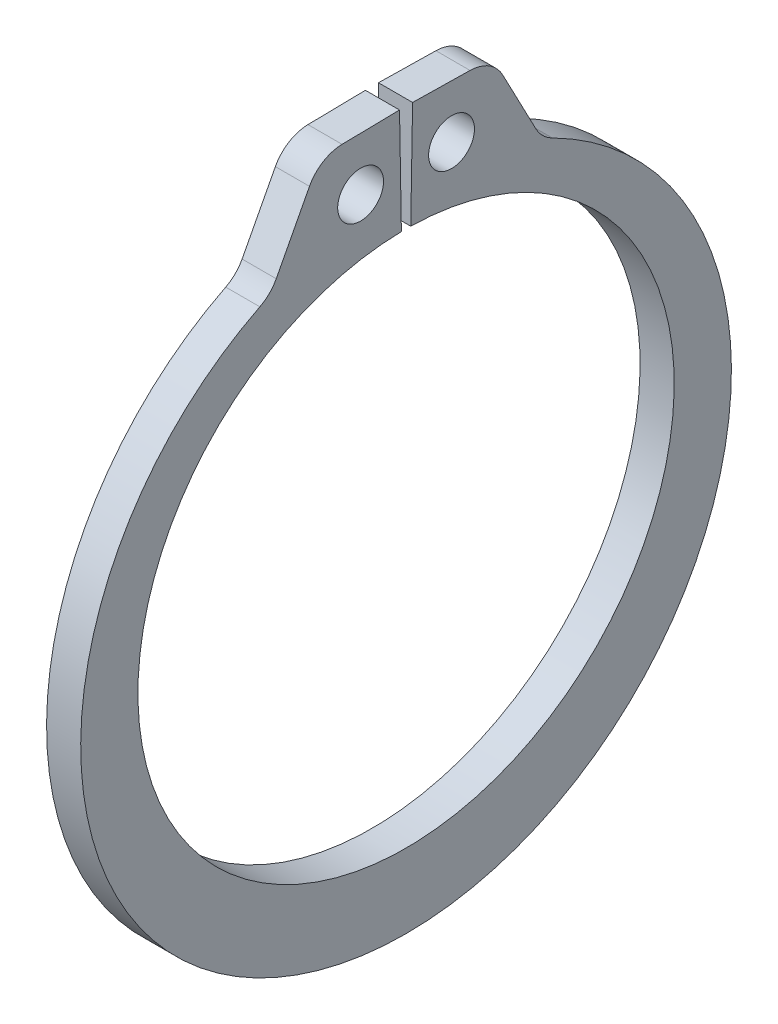
ISO-10303-21;
HEADER;
FILE_DESCRIPTION(('STEP AP214'),'2;1');
FILE_NAME('part.step','',(''),(''),'','','');
FILE_SCHEMA(('AUTOMOTIVE_DESIGN { 1 0 10303 214 1 1 1 1 }'));
ENDSEC;
DATA;
#1=APPLICATION_CONTEXT('core data for automotive mechanical design processes');
#2=APPLICATION_PROTOCOL_DEFINITION('international standard','automotive_design',2000,#1);
#3=PRODUCT_CONTEXT('',#1,'mechanical');
#4=PRODUCT('Part','Part','',(#3));
#5=PRODUCT_RELATED_PRODUCT_CATEGORY('part','',(#4));
#6=PRODUCT_DEFINITION_FORMATION('','',#4);
#7=PRODUCT_DEFINITION_CONTEXT('part definition',#1,'design');
#8=PRODUCT_DEFINITION('design','',#6,#7);
#9=PRODUCT_DEFINITION_SHAPE('','',#8);
#10=(LENGTH_UNIT() NAMED_UNIT(*) SI_UNIT(.MILLI.,.METRE.));
#11=(NAMED_UNIT(*) PLANE_ANGLE_UNIT() SI_UNIT($,.RADIAN.));
#12=(NAMED_UNIT(*) SI_UNIT($,.STERADIAN.) SOLID_ANGLE_UNIT());
#13=UNCERTAINTY_MEASURE_WITH_UNIT(LENGTH_MEASURE(1.E-05),#10,'distance_accuracy_value','');
#14=(GEOMETRIC_REPRESENTATION_CONTEXT(3) GLOBAL_UNCERTAINTY_ASSIGNED_CONTEXT((#13)) GLOBAL_UNIT_ASSIGNED_CONTEXT((#10,
#11,#12)) REPRESENTATION_CONTEXT('',''));
#15=CARTESIAN_POINT('',(0.,0.,0.));
#16=DIRECTION('',(0.,0.,1.));
#17=DIRECTION('',(1.,0.,0.));
#18=AXIS2_PLACEMENT_3D('',#15,#16,#17);
#19=CARTESIAN_POINT('',(0.4445,0.,0.));
#20=DIRECTION('',(1.,0.,0.));
#21=DIRECTION('',(0.,0.,-1.));
#22=AXIS2_PLACEMENT_3D('',#19,#20,#21);
#23=PLANE('',#22);
#24=CARTESIAN_POINT('',(0.4445,8.34990579039907,1.18413129849929));
#25=DIRECTION('',(1.,0.,0.));
#26=DIRECTION('',(0.,0.,-1.));
#27=AXIS2_PLACEMENT_3D('',#24,#25,#26);
#28=CIRCLE('',#27,0.5969);
#29=CARTESIAN_POINT('',(0.4445,8.34990579039907,0.587231298499288));
#30=VERTEX_POINT('',#29);
#31=EDGE_CURVE('E221',#30,#30,#28,.T.);
#32=ORIENTED_EDGE('',*,*,#31,.F.);
#33=EDGE_LOOP('',(#32));
#34=FACE_BOUND('',#33,.T.);
#35=DIRECTION('',(0.,-0.0174524064372785,0.999847695156391));
#36=VECTOR('',#35,1.);
#37=CARTESIAN_POINT('',(0.4445,9.75211447947738,0.170223791426689));
#38=LINE('',#37,#36);
#39=CARTESIAN_POINT('',(0.4445,9.75211447947738,0.170223791426689));
#40=VERTEX_POINT('',#39);
#41=CARTESIAN_POINT('',(0.4445,9.72599428346698,1.66664881865075));
#42=VERTEX_POINT('',#41);
#43=EDGE_CURVE('E133',#40,#42,#38,.T.);
#44=ORIENTED_EDGE('',*,*,#43,.T.);
#45=CARTESIAN_POINT('',(0.4445,8.74824322237355,1.64958211039574));
#46=DIRECTION('',(1.,0.,0.));
#47=DIRECTION('',(0.,0.,-1.));
#48=AXIS2_PLACEMENT_3D('',#45,#46,#47);
#49=CIRCLE('',#48,0.9779);
#50=CARTESIAN_POINT('',(0.4445,9.20239794825594,2.51562592854739));
#51=VERTEX_POINT('',#50);
#52=EDGE_CURVE('E174',#42,#51,#49,.T.);
#53=ORIENTED_EDGE('',*,*,#52,.T.);
#54=DIRECTION('',(0.,-0.885615930209273,0.464418371901418));
#55=VECTOR('',#54,1.);
#56=CARTESIAN_POINT('',(0.4445,9.71587543013069,2.24635753803418));
#57=LINE('',#56,#55);
#58=CARTESIAN_POINT('',(0.4445,7.55065021083085,3.38180501232419));
#59=VERTEX_POINT('',#58);
#60=EDGE_CURVE('E213',#51,#59,#57,.T.);
#61=ORIENTED_EDGE('',*,*,#60,.T.);
#62=CARTESIAN_POINT('',(0.4445,8.00480493671325,4.24784883047584));
#63=DIRECTION('',(1.,0.,0.));
#64=DIRECTION('',(0.,0.,-1.));
#65=AXIS2_PLACEMENT_3D('',#62,#63,#64);
#66=CIRCLE('',#65,0.9779);
#67=CARTESIAN_POINT('',(0.4445,7.13119661908455,3.80842088715641));
#68=VERTEX_POINT('',#67);
#69=EDGE_CURVE('E181',#59,#68,#66,.F.);
#70=ORIENTED_EDGE('',*,*,#69,.T.);
#71=CARTESIAN_POINT('',(0.4445,-0.440165681906266,0.));
#72=DIRECTION('',(1.,0.,0.));
#73=DIRECTION('',(0.,0.,-1.));
#74=AXIS2_PLACEMENT_3D('',#71,#72,#73);
#75=CIRCLE('',#74,8.47523431809375);
#76=CARTESIAN_POINT('',(0.4445,7.13119661908455,-3.80842088715641));
#77=VERTEX_POINT('',#76);
#78=EDGE_CURVE('E206',#68,#77,#75,.T.);
#79=ORIENTED_EDGE('',*,*,#78,.T.);
#80=CARTESIAN_POINT('',(0.4445,8.00480493671325,-4.24784883047584));
#81=DIRECTION('',(1.,0.,0.));
#82=DIRECTION('',(0.,0.,-1.));
#83=AXIS2_PLACEMENT_3D('',#80,#81,#82);
#84=CIRCLE('',#83,0.9779);
#85=CARTESIAN_POINT('',(0.4445,7.55065021083085,-3.38180501232419));
#86=VERTEX_POINT('',#85);
#87=EDGE_CURVE('E11',#77,#86,#84,.F.);
#88=ORIENTED_EDGE('',*,*,#87,.T.);
#89=DIRECTION('',(0.,0.885615930209273,0.464418371901418));
#90=VECTOR('',#89,1.);
#91=CARTESIAN_POINT('',(0.4445,9.71587543013069,-2.24635753803418));
#92=LINE('',#91,#90);
#93=CARTESIAN_POINT('',(0.4445,9.20239794825594,-2.51562592854739));
#94=VERTEX_POINT('',#93);
#95=EDGE_CURVE('E205',#86,#94,#92,.T.);
#96=ORIENTED_EDGE('',*,*,#95,.T.);
#97=CARTESIAN_POINT('',(0.4445,8.74824322237355,-1.64958211039574));
#98=DIRECTION('',(1.,0.,0.));
#99=DIRECTION('',(0.,0.,-1.));
#100=AXIS2_PLACEMENT_3D('',#97,#98,#99);
#101=CIRCLE('',#100,0.9779);
#102=CARTESIAN_POINT('',(0.4445,9.72599428346698,-1.66664881865075));
#103=VERTEX_POINT('',#102);
#104=EDGE_CURVE('E49',#94,#103,#101,.T.);
#105=ORIENTED_EDGE('',*,*,#104,.T.);
#106=DIRECTION('',(0.,0.0174524064372785,0.999847695156391));
#107=VECTOR('',#106,1.);
#108=CARTESIAN_POINT('',(0.4445,9.75211447947738,-0.170223791426689));
#109=LINE('',#108,#107);
#110=CARTESIAN_POINT('',(0.4445,9.75211447947738,-0.170223791426689));
#111=VERTEX_POINT('',#110);
#112=EDGE_CURVE('E210',#103,#111,#109,.T.);
#113=ORIENTED_EDGE('',*,*,#112,.T.);
#114=DIRECTION('',(0.,-0.999847695156391,0.0174524064372834));
#115=VECTOR('',#114,1.);
#116=CARTESIAN_POINT('',(0.4445,6.98393615066739,-0.121905058964426));
#117=LINE('',#116,#115);
#118=CARTESIAN_POINT('',(0.4445,6.98393615066739,-0.121905058964426));
#119=VERTEX_POINT('',#118);
#120=EDGE_CURVE('E139',#111,#119,#117,.T.);
#121=ORIENTED_EDGE('',*,*,#120,.T.);
#122=CARTESIAN_POINT('',(0.4445,0.,0.));
#123=DIRECTION('',(-1.,0.,0.));
#124=DIRECTION('',(0.,0.,-1.));
#125=AXIS2_PLACEMENT_3D('',#122,#123,#124);
#126=CIRCLE('',#125,6.985);
#127=CARTESIAN_POINT('',(0.4445,6.98393615066739,0.121905058964426));
#128=VERTEX_POINT('',#127);
#129=EDGE_CURVE('E134',#119,#128,#126,.T.);
#130=ORIENTED_EDGE('',*,*,#129,.T.);
#131=DIRECTION('',(0.,0.999847695156391,0.0174524064372834));
#132=VECTOR('',#131,1.);
#133=CARTESIAN_POINT('',(0.4445,6.98393615066739,0.121905058964426));
#134=LINE('',#133,#132);
#135=EDGE_CURVE('E125',#128,#40,#134,.T.);
#136=ORIENTED_EDGE('',*,*,#135,.T.);
#137=EDGE_LOOP('',(#44,#53,#61,#70,#79,#88,#96,#105,#113,#121,#130,#136));
#138=FACE_BOUND('',#137,.T.);
#139=CARTESIAN_POINT('',(0.4445,8.34990579039907,-1.18413129849929));
#140=DIRECTION('',(1.,0.,0.));
#141=DIRECTION('',(0.,0.,-1.));
#142=AXIS2_PLACEMENT_3D('',#139,#140,#141);
#143=CIRCLE('',#142,0.5969);
#144=CARTESIAN_POINT('',(0.4445,8.34990579039907,-1.78103129849929));
#145=VERTEX_POINT('',#144);
#146=EDGE_CURVE('E247',#145,#145,#143,.T.);
#147=ORIENTED_EDGE('',*,*,#146,.F.);
#148=EDGE_LOOP('',(#147));
#149=FACE_BOUND('',#148,.T.);
#150=ADVANCED_FACE('F34',(#34,#138,#149),#23,.T.);
#151=CARTESIAN_POINT('',(-0.4445,0.,0.));
#152=DIRECTION('',(1.,0.,0.));
#153=DIRECTION('',(0.,0.,-1.));
#154=AXIS2_PLACEMENT_3D('',#151,#152,#153);
#155=PLANE('',#154);
#156=CARTESIAN_POINT('',(-0.4445,8.34990579039907,1.18413129849929));
#157=DIRECTION('',(1.,0.,0.));
#158=DIRECTION('',(0.,0.,-1.));
#159=AXIS2_PLACEMENT_3D('',#156,#157,#158);
#160=CIRCLE('',#159,0.5969);
#161=CARTESIAN_POINT('',(-0.4445,8.34990579039907,0.587231298499288));
#162=VERTEX_POINT('',#161);
#163=EDGE_CURVE('E244',#162,#162,#160,.T.);
#164=ORIENTED_EDGE('',*,*,#163,.T.);
#165=EDGE_LOOP('',(#164));
#166=FACE_BOUND('',#165,.T.);
#167=DIRECTION('',(0.,-0.885615930209273,0.464418371901418));
#168=VECTOR('',#167,1.);
#169=CARTESIAN_POINT('',(-0.4445,9.71587543013069,2.24635753803418));
#170=LINE('',#169,#168);
#171=CARTESIAN_POINT('',(-0.4445,9.20239794825594,2.51562592854739));
#172=VERTEX_POINT('',#171);
#173=CARTESIAN_POINT('',(-0.4445,7.55065021083085,3.38180501232419));
#174=VERTEX_POINT('',#173);
#175=EDGE_CURVE('E200',#172,#174,#170,.T.);
#176=ORIENTED_EDGE('',*,*,#175,.F.);
#177=CARTESIAN_POINT('',(-0.4445,8.74824322237355,1.64958211039574));
#178=DIRECTION('',(1.,0.,0.));
#179=DIRECTION('',(0.,0.,-1.));
#180=AXIS2_PLACEMENT_3D('',#177,#178,#179);
#181=CIRCLE('',#180,0.9779);
#182=CARTESIAN_POINT('',(-0.4445,9.72599428346698,1.66664881865075));
#183=VERTEX_POINT('',#182);
#184=EDGE_CURVE('E170',#172,#183,#181,.F.);
#185=ORIENTED_EDGE('',*,*,#184,.T.);
#186=DIRECTION('',(0.,-0.0174524064372785,0.999847695156391));
#187=VECTOR('',#186,1.);
#188=CARTESIAN_POINT('',(-0.4445,9.75211447947738,0.170223791426689));
#189=LINE('',#188,#187);
#190=CARTESIAN_POINT('',(-0.4445,9.75211447947738,0.170223791426689));
#191=VERTEX_POINT('',#190);
#192=EDGE_CURVE('E223',#191,#183,#189,.T.);
#193=ORIENTED_EDGE('',*,*,#192,.F.);
#194=DIRECTION('',(0.,0.999847695156391,0.0174524064372834));
#195=VECTOR('',#194,1.);
#196=CARTESIAN_POINT('',(-0.4445,6.98393615066739,0.121905058964426));
#197=LINE('',#196,#195);
#198=CARTESIAN_POINT('',(-0.4445,6.98393615066739,0.121905058964426));
#199=VERTEX_POINT('',#198);
#200=EDGE_CURVE('E220',#199,#191,#197,.T.);
#201=ORIENTED_EDGE('',*,*,#200,.F.);
#202=CARTESIAN_POINT('',(-0.4445,0.,0.));
#203=DIRECTION('',(-1.,0.,0.));
#204=DIRECTION('',(0.,0.,-1.));
#205=AXIS2_PLACEMENT_3D('',#202,#203,#204);
#206=CIRCLE('',#205,6.985);
#207=CARTESIAN_POINT('',(-0.4445,6.98393615066739,-0.121905058964426));
#208=VERTEX_POINT('',#207);
#209=EDGE_CURVE('E147',#208,#199,#206,.T.);
#210=ORIENTED_EDGE('',*,*,#209,.F.);
#211=DIRECTION('',(0.,-0.999847695156391,0.0174524064372834));
#212=VECTOR('',#211,1.);
#213=CARTESIAN_POINT('',(-0.4445,6.98393615066739,-0.121905058964426));
#214=LINE('',#213,#212);
#215=CARTESIAN_POINT('',(-0.4445,9.75211447947738,-0.170223791426689));
#216=VERTEX_POINT('',#215);
#217=EDGE_CURVE('E143',#216,#208,#214,.T.);
#218=ORIENTED_EDGE('',*,*,#217,.F.);
#219=DIRECTION('',(0.,0.0174524064372785,0.999847695156391));
#220=VECTOR('',#219,1.);
#221=CARTESIAN_POINT('',(-0.4445,9.75211447947738,-0.170223791426689));
#222=LINE('',#221,#220);
#223=CARTESIAN_POINT('',(-0.4445,9.72599428346698,-1.66664881865075));
#224=VERTEX_POINT('',#223);
#225=EDGE_CURVE('E228',#224,#216,#222,.T.);
#226=ORIENTED_EDGE('',*,*,#225,.F.);
#227=CARTESIAN_POINT('',(-0.4445,8.74824322237355,-1.64958211039574));
#228=DIRECTION('',(1.,0.,0.));
#229=DIRECTION('',(0.,0.,-1.));
#230=AXIS2_PLACEMENT_3D('',#227,#228,#229);
#231=CIRCLE('',#230,0.9779);
#232=CARTESIAN_POINT('',(-0.4445,9.20239794825594,-2.51562592854739));
#233=VERTEX_POINT('',#232);
#234=EDGE_CURVE('E168',#224,#233,#231,.F.);
#235=ORIENTED_EDGE('',*,*,#234,.T.);
#236=DIRECTION('',(0.,0.885615930209273,0.464418371901418));
#237=VECTOR('',#236,1.);
#238=CARTESIAN_POINT('',(-0.4445,9.71587543013069,-2.24635753803418));
#239=LINE('',#238,#237);
#240=CARTESIAN_POINT('',(-0.4445,7.55065021083085,-3.38180501232419));
#241=VERTEX_POINT('',#240);
#242=EDGE_CURVE('E191',#241,#233,#239,.T.);
#243=ORIENTED_EDGE('',*,*,#242,.F.);
#244=CARTESIAN_POINT('',(-0.4445,8.00480493671325,-4.24784883047584));
#245=DIRECTION('',(1.,0.,0.));
#246=DIRECTION('',(0.,0.,-1.));
#247=AXIS2_PLACEMENT_3D('',#244,#245,#246);
#248=CIRCLE('',#247,0.9779);
#249=CARTESIAN_POINT('',(-0.4445,7.13119661908455,-3.80842088715641));
#250=VERTEX_POINT('',#249);
#251=EDGE_CURVE('E42',#241,#250,#248,.T.);
#252=ORIENTED_EDGE('',*,*,#251,.T.);
#253=CARTESIAN_POINT('',(-0.4445,-0.440165681906266,0.));
#254=DIRECTION('',(1.,0.,0.));
#255=DIRECTION('',(0.,0.,-1.));
#256=AXIS2_PLACEMENT_3D('',#253,#254,#255);
#257=CIRCLE('',#256,8.47523431809375);
#258=CARTESIAN_POINT('',(-0.4445,7.13119661908455,3.80842088715641));
#259=VERTEX_POINT('',#258);
#260=EDGE_CURVE('E189',#259,#250,#257,.T.);
#261=ORIENTED_EDGE('',*,*,#260,.F.);
#262=CARTESIAN_POINT('',(-0.4445,8.00480493671325,4.24784883047584));
#263=DIRECTION('',(1.,0.,0.));
#264=DIRECTION('',(0.,0.,-1.));
#265=AXIS2_PLACEMENT_3D('',#262,#263,#264);
#266=CIRCLE('',#265,0.9779);
#267=EDGE_CURVE('E179',#259,#174,#266,.T.);
#268=ORIENTED_EDGE('',*,*,#267,.T.);
#269=EDGE_LOOP('',(#176,#185,#193,#201,#210,#218,#226,#235,#243,#252,#261,#268));
#270=FACE_BOUND('',#269,.T.);
#271=CARTESIAN_POINT('',(-0.4445,8.34990579039907,-1.18413129849929));
#272=DIRECTION('',(1.,0.,0.));
#273=DIRECTION('',(0.,0.,-1.));
#274=AXIS2_PLACEMENT_3D('',#271,#272,#273);
#275=CIRCLE('',#274,0.5969);
#276=CARTESIAN_POINT('',(-0.4445,8.34990579039907,-1.78103129849929));
#277=VERTEX_POINT('',#276);
#278=EDGE_CURVE('E250',#277,#277,#275,.T.);
#279=ORIENTED_EDGE('',*,*,#278,.T.);
#280=EDGE_LOOP('',(#279));
#281=FACE_BOUND('',#280,.T.);
#282=ADVANCED_FACE('F187',(#166,#270,#281),#155,.F.);
#283=CARTESIAN_POINT('',(0.4445,0.,0.));
#284=DIRECTION('',(-1.,0.,0.));
#285=DIRECTION('',(0.,0.,1.));
#286=AXIS2_PLACEMENT_3D('',#283,#284,#285);
#287=CYLINDRICAL_SURFACE('',#286,6.985);
#288=ORIENTED_EDGE('',*,*,#209,.T.);
#289=DIRECTION('',(-1.,0.,0.));
#290=VECTOR('',#289,1.);
#291=CARTESIAN_POINT('',(0.4445,6.98393615066739,0.121905058964426));
#292=LINE('',#291,#290);
#293=EDGE_CURVE('E129',#128,#199,#292,.T.);
#294=ORIENTED_EDGE('',*,*,#293,.F.);
#295=ORIENTED_EDGE('',*,*,#129,.F.);
#296=DIRECTION('',(-1.,0.,0.));
#297=VECTOR('',#296,1.);
#298=CARTESIAN_POINT('',(0.4445,6.98393615066739,-0.121905058964426));
#299=LINE('',#298,#297);
#300=EDGE_CURVE('E218',#119,#208,#299,.T.);
#301=ORIENTED_EDGE('',*,*,#300,.T.);
#302=EDGE_LOOP('',(#288,#294,#295,#301));
#303=FACE_BOUND('',#302,.T.);
#304=ADVANCED_FACE('F145',(#303),#287,.F.);
#305=CARTESIAN_POINT('',(0.4445,6.98393615066739,0.121905058964426));
#306=DIRECTION('',(0.,-0.0174524064372834,0.999847695156391));
#307=DIRECTION('',(0.,-0.999847695156391,-0.0174524064372834));
#308=AXIS2_PLACEMENT_3D('',#305,#306,#307);
#309=PLANE('',#308);
#310=ORIENTED_EDGE('',*,*,#200,.T.);
#311=DIRECTION('',(-1.,0.,0.));
#312=VECTOR('',#311,1.);
#313=CARTESIAN_POINT('',(0.4445,9.75211447947738,0.170223791426689));
#314=LINE('',#313,#312);
#315=EDGE_CURVE('E132',#40,#191,#314,.T.);
#316=ORIENTED_EDGE('',*,*,#315,.F.);
#317=ORIENTED_EDGE('',*,*,#135,.F.);
#318=ORIENTED_EDGE('',*,*,#293,.T.);
#319=EDGE_LOOP('',(#310,#316,#317,#318));
#320=FACE_BOUND('',#319,.T.);
#321=ADVANCED_FACE('F127',(#320),#309,.F.);
#322=CARTESIAN_POINT('',(0.4445,9.75211447947738,0.170223791426689));
#323=DIRECTION('',(0.,-0.999847695156391,-0.0174524064372785));
#324=DIRECTION('',(0.,0.0174524064372785,-0.999847695156391));
#325=AXIS2_PLACEMENT_3D('',#322,#323,#324);
#326=PLANE('',#325);
#327=ORIENTED_EDGE('',*,*,#192,.T.);
#328=DIRECTION('',(-1.,0.,0.));
#329=VECTOR('',#328,1.);
#330=CARTESIAN_POINT('',(0.4445,9.72599428346698,1.66664881865075));
#331=LINE('',#330,#329);
#332=EDGE_CURVE('E57',#183,#42,#331,.F.);
#333=ORIENTED_EDGE('',*,*,#332,.T.);
#334=ORIENTED_EDGE('',*,*,#43,.F.);
#335=ORIENTED_EDGE('',*,*,#315,.T.);
#336=EDGE_LOOP('',(#327,#333,#334,#335));
#337=FACE_BOUND('',#336,.T.);
#338=ADVANCED_FACE('F239',(#337),#326,.F.);
#339=CARTESIAN_POINT('',(0.4445,9.71587543013069,2.24635753803418));
#340=DIRECTION('',(0.,-0.464418371901418,-0.885615930209273));
#341=DIRECTION('',(0.,0.885615930209273,-0.464418371901418));
#342=AXIS2_PLACEMENT_3D('',#339,#340,#341);
#343=PLANE('',#342);
#344=ORIENTED_EDGE('',*,*,#175,.T.);
#345=DIRECTION('',(1.,0.,0.));
#346=VECTOR('',#345,1.);
#347=CARTESIAN_POINT('',(0.4445,7.55065021083085,3.38180501232419));
#348=LINE('',#347,#346);
#349=EDGE_CURVE('E161',#174,#59,#348,.T.);
#350=ORIENTED_EDGE('',*,*,#349,.T.);
#351=ORIENTED_EDGE('',*,*,#60,.F.);
#352=DIRECTION('',(-1.,0.,0.));
#353=VECTOR('',#352,1.);
#354=CARTESIAN_POINT('',(0.4445,9.20239794825594,2.51562592854739));
#355=LINE('',#354,#353);
#356=EDGE_CURVE('E158',#51,#172,#355,.T.);
#357=ORIENTED_EDGE('',*,*,#356,.T.);
#358=EDGE_LOOP('',(#344,#350,#351,#357));
#359=FACE_BOUND('',#358,.T.);
#360=ADVANCED_FACE('F280',(#359),#343,.F.);
#361=CARTESIAN_POINT('',(0.4445,-0.440165681906266,0.));
#362=DIRECTION('',(-1.,0.,0.));
#363=DIRECTION('',(0.,0.,1.));
#364=AXIS2_PLACEMENT_3D('',#361,#362,#363);
#365=CYLINDRICAL_SURFACE('',#364,8.47523431809375);
#366=ORIENTED_EDGE('',*,*,#78,.F.);
#367=DIRECTION('',(-1.,0.,0.));
#368=VECTOR('',#367,1.);
#369=CARTESIAN_POINT('',(0.4445,7.13119661908455,3.80842088715641));
#370=LINE('',#369,#368);
#371=EDGE_CURVE('E150',#68,#259,#370,.T.);
#372=ORIENTED_EDGE('',*,*,#371,.T.);
#373=ORIENTED_EDGE('',*,*,#260,.T.);
#374=DIRECTION('',(-1.,0.,0.));
#375=VECTOR('',#374,1.);
#376=CARTESIAN_POINT('',(0.4445,7.13119661908455,-3.80842088715641));
#377=LINE('',#376,#375);
#378=EDGE_CURVE('E148',#250,#77,#377,.F.);
#379=ORIENTED_EDGE('',*,*,#378,.T.);
#380=EDGE_LOOP('',(#366,#372,#373,#379));
#381=FACE_BOUND('',#380,.T.);
#382=ADVANCED_FACE('F197',(#381),#365,.T.);
#383=CARTESIAN_POINT('',(0.4445,9.71587543013069,-2.24635753803418));
#384=DIRECTION('',(0.,-0.464418371901418,0.885615930209273));
#385=DIRECTION('',(0.,-0.885615930209273,-0.464418371901418));
#386=AXIS2_PLACEMENT_3D('',#383,#384,#385);
#387=PLANE('',#386);
#388=ORIENTED_EDGE('',*,*,#95,.F.);
#389=DIRECTION('',(1.,0.,0.));
#390=VECTOR('',#389,1.);
#391=CARTESIAN_POINT('',(-0.4445,7.55065021083085,-3.38180501232419));
#392=LINE('',#391,#390);
#393=EDGE_CURVE('E165',#86,#241,#392,.F.);
#394=ORIENTED_EDGE('',*,*,#393,.T.);
#395=ORIENTED_EDGE('',*,*,#242,.T.);
#396=DIRECTION('',(-1.,0.,0.));
#397=VECTOR('',#396,1.);
#398=CARTESIAN_POINT('',(0.4445,9.20239794825594,-2.51562592854739));
#399=LINE('',#398,#397);
#400=EDGE_CURVE('E163',#233,#94,#399,.F.);
#401=ORIENTED_EDGE('',*,*,#400,.T.);
#402=EDGE_LOOP('',(#388,#394,#395,#401));
#403=FACE_BOUND('',#402,.T.);
#404=ADVANCED_FACE('F208',(#403),#387,.F.);
#405=CARTESIAN_POINT('',(0.4445,9.75211447947738,-0.170223791426689));
#406=DIRECTION('',(0.,-0.999847695156391,0.0174524064372785));
#407=DIRECTION('',(0.,-0.0174524064372785,-0.999847695156391));
#408=AXIS2_PLACEMENT_3D('',#405,#406,#407);
#409=PLANE('',#408);
#410=ORIENTED_EDGE('',*,*,#112,.F.);
#411=DIRECTION('',(-1.,0.,0.));
#412=VECTOR('',#411,1.);
#413=CARTESIAN_POINT('',(0.4445,9.72599428346698,-1.66664881865075));
#414=LINE('',#413,#412);
#415=EDGE_CURVE('E176',#103,#224,#414,.T.);
#416=ORIENTED_EDGE('',*,*,#415,.T.);
#417=ORIENTED_EDGE('',*,*,#225,.T.);
#418=DIRECTION('',(-1.,0.,0.));
#419=VECTOR('',#418,1.);
#420=CARTESIAN_POINT('',(0.4445,9.75211447947738,-0.170223791426689));
#421=LINE('',#420,#419);
#422=EDGE_CURVE('E152',#111,#216,#421,.T.);
#423=ORIENTED_EDGE('',*,*,#422,.F.);
#424=EDGE_LOOP('',(#410,#416,#417,#423));
#425=FACE_BOUND('',#424,.T.);
#426=ADVANCED_FACE('F273',(#425),#409,.F.);
#427=CARTESIAN_POINT('',(0.4445,6.98393615066739,-0.121905058964426));
#428=DIRECTION('',(0.,-0.0174524064372834,-0.999847695156391));
#429=DIRECTION('',(0.,0.999847695156391,-0.0174524064372834));
#430=AXIS2_PLACEMENT_3D('',#427,#428,#429);
#431=PLANE('',#430);
#432=ORIENTED_EDGE('',*,*,#217,.T.);
#433=ORIENTED_EDGE('',*,*,#300,.F.);
#434=ORIENTED_EDGE('',*,*,#120,.F.);
#435=ORIENTED_EDGE('',*,*,#422,.T.);
#436=EDGE_LOOP('',(#432,#433,#434,#435));
#437=FACE_BOUND('',#436,.T.);
#438=ADVANCED_FACE('F235',(#437),#431,.F.);
#439=CARTESIAN_POINT('',(0.4445,8.34990579039907,1.18413129849929));
#440=DIRECTION('',(-1.,0.,0.));
#441=DIRECTION('',(0.,0.,1.));
#442=AXIS2_PLACEMENT_3D('',#439,#440,#441);
#443=CYLINDRICAL_SURFACE('',#442,0.5969);
#444=ORIENTED_EDGE('',*,*,#31,.T.);
#445=EDGE_LOOP('',(#444));
#446=FACE_BOUND('',#445,.T.);
#447=ORIENTED_EDGE('',*,*,#163,.F.);
#448=EDGE_LOOP('',(#447));
#449=FACE_BOUND('',#448,.T.);
#450=ADVANCED_FACE('F268',(#446,#449),#443,.F.);
#451=CARTESIAN_POINT('',(0.4445,8.34990579039907,-1.18413129849929));
#452=DIRECTION('',(-1.,0.,0.));
#453=DIRECTION('',(0.,0.,1.));
#454=AXIS2_PLACEMENT_3D('',#451,#452,#453);
#455=CYLINDRICAL_SURFACE('',#454,0.5969);
#456=ORIENTED_EDGE('',*,*,#146,.T.);
#457=EDGE_LOOP('',(#456));
#458=FACE_BOUND('',#457,.T.);
#459=ORIENTED_EDGE('',*,*,#278,.F.);
#460=EDGE_LOOP('',(#459));
#461=FACE_BOUND('',#460,.T.);
#462=ADVANCED_FACE('F256',(#458,#461),#455,.F.);
#463=CARTESIAN_POINT('',(0.4445,8.00480493671325,4.24784883047584));
#464=DIRECTION('',(-1.,0.,0.));
#465=DIRECTION('',(0.,0.,1.));
#466=AXIS2_PLACEMENT_3D('',#463,#464,#465);
#467=CYLINDRICAL_SURFACE('',#466,0.9779);
#468=ORIENTED_EDGE('',*,*,#69,.F.);
#469=ORIENTED_EDGE('',*,*,#349,.F.);
#470=ORIENTED_EDGE('',*,*,#267,.F.);
#471=ORIENTED_EDGE('',*,*,#371,.F.);
#472=EDGE_LOOP('',(#468,#469,#470,#471));
#473=FACE_BOUND('',#472,.T.);
#474=ADVANCED_FACE('F290',(#473),#467,.F.);
#475=CARTESIAN_POINT('',(0.4445,8.00480493671325,-4.24784883047584));
#476=DIRECTION('',(-1.,0.,0.));
#477=DIRECTION('',(0.,0.,1.));
#478=AXIS2_PLACEMENT_3D('',#475,#476,#477);
#479=CYLINDRICAL_SURFACE('',#478,0.9779);
#480=ORIENTED_EDGE('',*,*,#87,.F.);
#481=ORIENTED_EDGE('',*,*,#378,.F.);
#482=ORIENTED_EDGE('',*,*,#251,.F.);
#483=ORIENTED_EDGE('',*,*,#393,.F.);
#484=EDGE_LOOP('',(#480,#481,#482,#483));
#485=FACE_BOUND('',#484,.T.);
#486=ADVANCED_FACE('F203',(#485),#479,.F.);
#487=CARTESIAN_POINT('',(0.4445,8.74824322237355,1.64958211039574));
#488=DIRECTION('',(-1.,0.,0.));
#489=DIRECTION('',(0.,0.,1.));
#490=AXIS2_PLACEMENT_3D('',#487,#488,#489);
#491=CYLINDRICAL_SURFACE('',#490,0.9779);
#492=ORIENTED_EDGE('',*,*,#52,.F.);
#493=ORIENTED_EDGE('',*,*,#332,.F.);
#494=ORIENTED_EDGE('',*,*,#184,.F.);
#495=ORIENTED_EDGE('',*,*,#356,.F.);
#496=EDGE_LOOP('',(#492,#493,#494,#495));
#497=FACE_BOUND('',#496,.T.);
#498=ADVANCED_FACE('F295',(#497),#491,.T.);
#499=CARTESIAN_POINT('',(0.4445,8.74824322237355,-1.64958211039574));
#500=DIRECTION('',(-1.,0.,0.));
#501=DIRECTION('',(0.,0.,1.));
#502=AXIS2_PLACEMENT_3D('',#499,#500,#501);
#503=CYLINDRICAL_SURFACE('',#502,0.9779);
#504=ORIENTED_EDGE('',*,*,#104,.F.);
#505=ORIENTED_EDGE('',*,*,#400,.F.);
#506=ORIENTED_EDGE('',*,*,#234,.F.);
#507=ORIENTED_EDGE('',*,*,#415,.F.);
#508=EDGE_LOOP('',(#504,#505,#506,#507));
#509=FACE_BOUND('',#508,.T.);
#510=ADVANCED_FACE('F36',(#509),#503,.T.);
#511=CLOSED_SHELL('',(#150,#282,#304,#321,#338,#360,#382,#404,#426,#438,#450,#462,#474,#486,
#498,#510));
#512=MANIFOLD_SOLID_BREP('B2',#511);
#513=ADVANCED_BREP_SHAPE_REPRESENTATION('',(#18,#512),#14);
#514=SHAPE_DEFINITION_REPRESENTATION(#9,#513);
ENDSEC;
END-ISO-10303-21;
